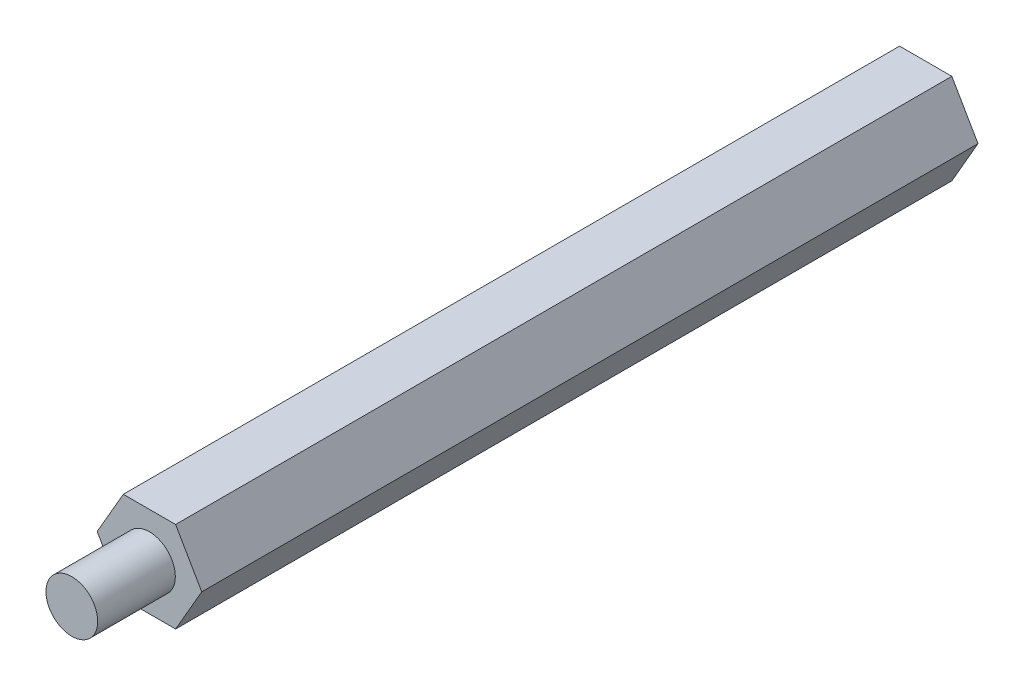
ISO-10303-21;
HEADER;
FILE_DESCRIPTION(('STEP AP214'),'2;1');
FILE_NAME('part.step','',(''),(''),'','','');
FILE_SCHEMA(('AUTOMOTIVE_DESIGN { 1 0 10303 214 1 1 1 1 }'));
ENDSEC;
DATA;
#1=APPLICATION_CONTEXT('core data for automotive mechanical design processes');
#2=APPLICATION_PROTOCOL_DEFINITION('international standard','automotive_design',2000,#1);
#3=PRODUCT_CONTEXT('',#1,'mechanical');
#4=PRODUCT('Part','Part','',(#3));
#5=PRODUCT_RELATED_PRODUCT_CATEGORY('part','',(#4));
#6=PRODUCT_DEFINITION_FORMATION('','',#4);
#7=PRODUCT_DEFINITION_CONTEXT('part definition',#1,'design');
#8=PRODUCT_DEFINITION('design','',#6,#7);
#9=PRODUCT_DEFINITION_SHAPE('','',#8);
#10=(LENGTH_UNIT() NAMED_UNIT(*) SI_UNIT(.MILLI.,.METRE.));
#11=(NAMED_UNIT(*) PLANE_ANGLE_UNIT() SI_UNIT($,.RADIAN.));
#12=(NAMED_UNIT(*) SI_UNIT($,.STERADIAN.) SOLID_ANGLE_UNIT());
#13=UNCERTAINTY_MEASURE_WITH_UNIT(LENGTH_MEASURE(1.E-05),#10,'distance_accuracy_value','');
#14=(GEOMETRIC_REPRESENTATION_CONTEXT(3) GLOBAL_UNCERTAINTY_ASSIGNED_CONTEXT((#13)) GLOBAL_UNIT_ASSIGNED_CONTEXT((#10,
#11,#12)) REPRESENTATION_CONTEXT('',''));
#15=CARTESIAN_POINT('',(0.,0.,0.));
#16=DIRECTION('',(0.,0.,1.));
#17=DIRECTION('',(1.,0.,0.));
#18=AXIS2_PLACEMENT_3D('',#15,#16,#17);
#19=CARTESIAN_POINT('',(2.02072594216373,-3.49999999999999,60.));
#20=DIRECTION('',(-0.866025403784441,0.499999999999996,0.));
#21=DIRECTION('',(-0.499999999999996,-0.866025403784441,0.));
#22=AXIS2_PLACEMENT_3D('',#19,#20,#21);
#23=PLANE('',#22);
#24=DIRECTION('',(0.499999999999996,0.866025403784441,0.));
#25=VECTOR('',#24,1.);
#26=CARTESIAN_POINT('',(2.02072594216373,-3.49999999999999,0.));
#27=LINE('',#26,#25);
#28=CARTESIAN_POINT('',(2.02072594216373,-3.49999999999999,0.));
#29=VERTEX_POINT('',#28);
#30=CARTESIAN_POINT('',(4.04145188432739,0.,0.));
#31=VERTEX_POINT('',#30);
#32=EDGE_CURVE('E126',#29,#31,#27,.T.);
#33=ORIENTED_EDGE('',*,*,#32,.T.);
#34=DIRECTION('',(0.,0.,-1.));
#35=VECTOR('',#34,1.);
#36=CARTESIAN_POINT('',(4.04145188432739,0.,60.));
#37=LINE('',#36,#35);
#38=CARTESIAN_POINT('',(4.04145188432739,0.,60.));
#39=VERTEX_POINT('',#38);
#40=EDGE_CURVE('E41',#39,#31,#37,.T.);
#41=ORIENTED_EDGE('',*,*,#40,.F.);
#42=DIRECTION('',(0.499999999999996,0.866025403784441,0.));
#43=VECTOR('',#42,1.);
#44=CARTESIAN_POINT('',(2.02072594216373,-3.49999999999999,60.));
#45=LINE('',#44,#43);
#46=CARTESIAN_POINT('',(2.02072594216373,-3.49999999999999,60.));
#47=VERTEX_POINT('',#46);
#48=EDGE_CURVE('E137',#47,#39,#45,.T.);
#49=ORIENTED_EDGE('',*,*,#48,.F.);
#50=DIRECTION('',(0.,0.,-1.));
#51=VECTOR('',#50,1.);
#52=CARTESIAN_POINT('',(2.02072594216373,-3.49999999999999,60.));
#53=LINE('',#52,#51);
#54=EDGE_CURVE('E122',#47,#29,#53,.T.);
#55=ORIENTED_EDGE('',*,*,#54,.T.);
#56=EDGE_LOOP('',(#33,#41,#49,#55));
#57=FACE_BOUND('',#56,.T.);
#58=ADVANCED_FACE('F38',(#57),#23,.F.);
#59=CARTESIAN_POINT('',(4.04145188432739,0.,60.));
#60=DIRECTION('',(-0.866025403784435,-0.500000000000006,0.));
#61=DIRECTION('',(0.500000000000006,-0.866025403784435,0.));
#62=AXIS2_PLACEMENT_3D('',#59,#60,#61);
#63=PLANE('',#62);
#64=DIRECTION('',(-0.500000000000006,0.866025403784435,0.));
#65=VECTOR('',#64,1.);
#66=CARTESIAN_POINT('',(4.04145188432739,0.,0.));
#67=LINE('',#66,#65);
#68=CARTESIAN_POINT('',(2.02072594216366,3.50000000000001,0.));
#69=VERTEX_POINT('',#68);
#70=EDGE_CURVE('E129',#31,#69,#67,.T.);
#71=ORIENTED_EDGE('',*,*,#70,.T.);
#72=DIRECTION('',(0.,0.,-1.));
#73=VECTOR('',#72,1.);
#74=CARTESIAN_POINT('',(2.02072594216366,3.50000000000001,60.));
#75=LINE('',#74,#73);
#76=CARTESIAN_POINT('',(2.02072594216366,3.50000000000001,60.));
#77=VERTEX_POINT('',#76);
#78=EDGE_CURVE('E140',#77,#69,#75,.T.);
#79=ORIENTED_EDGE('',*,*,#78,.F.);
#80=DIRECTION('',(-0.500000000000006,0.866025403784435,0.));
#81=VECTOR('',#80,1.);
#82=CARTESIAN_POINT('',(4.04145188432739,0.,60.));
#83=LINE('',#82,#81);
#84=EDGE_CURVE('E94',#39,#77,#83,.T.);
#85=ORIENTED_EDGE('',*,*,#84,.F.);
#86=ORIENTED_EDGE('',*,*,#40,.T.);
#87=EDGE_LOOP('',(#71,#79,#85,#86));
#88=FACE_BOUND('',#87,.T.);
#89=ADVANCED_FACE('F145',(#88),#63,.F.);
#90=CARTESIAN_POINT('',(2.02072594216366,3.50000000000001,60.));
#91=DIRECTION('',(0.,-1.,0.));
#92=DIRECTION('',(1.,0.,0.));
#93=AXIS2_PLACEMENT_3D('',#90,#91,#92);
#94=PLANE('',#93);
#95=DIRECTION('',(-1.,0.,0.));
#96=VECTOR('',#95,1.);
#97=CARTESIAN_POINT('',(2.02072594216366,3.50000000000001,0.));
#98=LINE('',#97,#96);
#99=CARTESIAN_POINT('',(-2.02072594216371,3.49999999999999,0.));
#100=VERTEX_POINT('',#99);
#101=EDGE_CURVE('E132',#69,#100,#98,.T.);
#102=ORIENTED_EDGE('',*,*,#101,.T.);
#103=DIRECTION('',(0.,0.,-1.));
#104=VECTOR('',#103,1.);
#105=CARTESIAN_POINT('',(-2.02072594216371,3.49999999999999,60.));
#106=LINE('',#105,#104);
#107=CARTESIAN_POINT('',(-2.02072594216371,3.49999999999999,60.));
#108=VERTEX_POINT('',#107);
#109=EDGE_CURVE('E117',#108,#100,#106,.T.);
#110=ORIENTED_EDGE('',*,*,#109,.F.);
#111=DIRECTION('',(-1.,0.,0.));
#112=VECTOR('',#111,1.);
#113=CARTESIAN_POINT('',(2.02072594216366,3.50000000000001,60.));
#114=LINE('',#113,#112);
#115=EDGE_CURVE('E108',#77,#108,#114,.T.);
#116=ORIENTED_EDGE('',*,*,#115,.F.);
#117=ORIENTED_EDGE('',*,*,#78,.T.);
#118=EDGE_LOOP('',(#102,#110,#116,#117));
#119=FACE_BOUND('',#118,.T.);
#120=ADVANCED_FACE('F151',(#119),#94,.F.);
#121=CARTESIAN_POINT('',(-2.02072594216371,3.49999999999999,60.));
#122=DIRECTION('',(0.866025403784442,-0.499999999999995,0.));
#123=DIRECTION('',(0.499999999999995,0.866025403784442,0.));
#124=AXIS2_PLACEMENT_3D('',#121,#122,#123);
#125=PLANE('',#124);
#126=DIRECTION('',(-0.499999999999995,-0.866025403784442,0.));
#127=VECTOR('',#126,1.);
#128=CARTESIAN_POINT('',(-2.02072594216371,3.49999999999999,0.));
#129=LINE('',#128,#127);
#130=CARTESIAN_POINT('',(-4.04145188432738,0.,0.));
#131=VERTEX_POINT('',#130);
#132=EDGE_CURVE('E116',#100,#131,#129,.T.);
#133=ORIENTED_EDGE('',*,*,#132,.T.);
#134=DIRECTION('',(0.,0.,-1.));
#135=VECTOR('',#134,1.);
#136=CARTESIAN_POINT('',(-4.04145188432738,0.,60.));
#137=LINE('',#136,#135);
#138=CARTESIAN_POINT('',(-4.04145188432738,0.,60.));
#139=VERTEX_POINT('',#138);
#140=EDGE_CURVE('E113',#139,#131,#137,.T.);
#141=ORIENTED_EDGE('',*,*,#140,.F.);
#142=DIRECTION('',(-0.499999999999995,-0.866025403784442,0.));
#143=VECTOR('',#142,1.);
#144=CARTESIAN_POINT('',(-2.02072594216371,3.49999999999999,60.));
#145=LINE('',#144,#143);
#146=EDGE_CURVE('E102',#108,#139,#145,.T.);
#147=ORIENTED_EDGE('',*,*,#146,.F.);
#148=ORIENTED_EDGE('',*,*,#109,.T.);
#149=EDGE_LOOP('',(#133,#141,#147,#148));
#150=FACE_BOUND('',#149,.T.);
#151=ADVANCED_FACE('F114',(#150),#125,.F.);
#152=CARTESIAN_POINT('',(-4.04145188432738,0.,60.));
#153=DIRECTION('',(0.866025403784436,0.500000000000004,0.));
#154=DIRECTION('',(-0.500000000000004,0.866025403784437,0.));
#155=AXIS2_PLACEMENT_3D('',#152,#153,#154);
#156=PLANE('',#155);
#157=DIRECTION('',(0.500000000000004,-0.866025403784436,0.));
#158=VECTOR('',#157,1.);
#159=CARTESIAN_POINT('',(-4.04145188432738,0.,0.));
#160=LINE('',#159,#158);
#161=CARTESIAN_POINT('',(-2.02072594216367,-3.50000000000001,0.));
#162=VERTEX_POINT('',#161);
#163=EDGE_CURVE('E79',#131,#162,#160,.T.);
#164=ORIENTED_EDGE('',*,*,#163,.T.);
#165=DIRECTION('',(0.,0.,-1.));
#166=VECTOR('',#165,1.);
#167=CARTESIAN_POINT('',(-2.02072594216367,-3.50000000000001,60.));
#168=LINE('',#167,#166);
#169=CARTESIAN_POINT('',(-2.02072594216367,-3.50000000000001,60.));
#170=VERTEX_POINT('',#169);
#171=EDGE_CURVE('E118',#170,#162,#168,.T.);
#172=ORIENTED_EDGE('',*,*,#171,.F.);
#173=DIRECTION('',(0.500000000000004,-0.866025403784436,0.));
#174=VECTOR('',#173,1.);
#175=CARTESIAN_POINT('',(-4.04145188432738,0.,60.));
#176=LINE('',#175,#174);
#177=EDGE_CURVE('E106',#139,#170,#176,.T.);
#178=ORIENTED_EDGE('',*,*,#177,.F.);
#179=ORIENTED_EDGE('',*,*,#140,.T.);
#180=EDGE_LOOP('',(#164,#172,#178,#179));
#181=FACE_BOUND('',#180,.T.);
#182=ADVANCED_FACE('F120',(#181),#156,.F.);
#183=CARTESIAN_POINT('',(-2.02072594216367,-3.50000000000001,60.));
#184=DIRECTION('',(0.,1.,0.));
#185=DIRECTION('',(-1.,0.,0.));
#186=AXIS2_PLACEMENT_3D('',#183,#184,#185);
#187=PLANE('',#186);
#188=DIRECTION('',(1.,0.,0.));
#189=VECTOR('',#188,1.);
#190=CARTESIAN_POINT('',(-2.02072594216367,-3.50000000000001,0.));
#191=LINE('',#190,#189);
#192=EDGE_CURVE('E85',#162,#29,#191,.T.);
#193=ORIENTED_EDGE('',*,*,#192,.T.);
#194=ORIENTED_EDGE('',*,*,#54,.F.);
#195=DIRECTION('',(1.,0.,0.));
#196=VECTOR('',#195,1.);
#197=CARTESIAN_POINT('',(-2.02072594216367,-3.50000000000001,60.));
#198=LINE('',#197,#196);
#199=EDGE_CURVE('E55',#170,#47,#198,.T.);
#200=ORIENTED_EDGE('',*,*,#199,.F.);
#201=ORIENTED_EDGE('',*,*,#171,.T.);
#202=EDGE_LOOP('',(#193,#194,#200,#201));
#203=FACE_BOUND('',#202,.T.);
#204=ADVANCED_FACE('F176',(#203),#187,.F.);
#205=CARTESIAN_POINT('',(0.,0.,60.));
#206=DIRECTION('',(0.,0.,1.));
#207=DIRECTION('',(1.,0.,0.));
#208=AXIS2_PLACEMENT_3D('',#205,#206,#207);
#209=PLANE('',#208);
#210=CARTESIAN_POINT('',(0.,0.,60.));
#211=DIRECTION('',(0.,0.,1.));
#212=DIRECTION('',(1.,0.,0.));
#213=AXIS2_PLACEMENT_3D('',#210,#211,#212);
#214=CIRCLE('',#213,2.);
#215=CARTESIAN_POINT('',(2.,0.,60.));
#216=VERTEX_POINT('',#215);
#217=EDGE_CURVE('E11',#216,#216,#214,.T.);
#218=ORIENTED_EDGE('',*,*,#217,.F.);
#219=EDGE_LOOP('',(#218));
#220=FACE_BOUND('',#219,.T.);
#221=ORIENTED_EDGE('',*,*,#48,.T.);
#222=ORIENTED_EDGE('',*,*,#84,.T.);
#223=ORIENTED_EDGE('',*,*,#115,.T.);
#224=ORIENTED_EDGE('',*,*,#146,.T.);
#225=ORIENTED_EDGE('',*,*,#177,.T.);
#226=ORIENTED_EDGE('',*,*,#199,.T.);
#227=EDGE_LOOP('',(#221,#222,#223,#224,#225,#226));
#228=FACE_BOUND('',#227,.T.);
#229=ADVANCED_FACE('F104',(#220,#228),#209,.T.);
#230=CARTESIAN_POINT('',(0.,0.,0.));
#231=DIRECTION('',(0.,0.,1.));
#232=DIRECTION('',(1.,0.,0.));
#233=AXIS2_PLACEMENT_3D('',#230,#231,#232);
#234=PLANE('',#233);
#235=CARTESIAN_POINT('',(0.,0.,0.));
#236=DIRECTION('',(0.,0.,-1.));
#237=DIRECTION('',(-1.,0.,0.));
#238=AXIS2_PLACEMENT_3D('',#235,#236,#237);
#239=CIRCLE('',#238,1.65);
#240=CARTESIAN_POINT('',(-1.65,0.,0.));
#241=VERTEX_POINT('',#240);
#242=EDGE_CURVE('E160',#241,#241,#239,.T.);
#243=ORIENTED_EDGE('',*,*,#242,.F.);
#244=EDGE_LOOP('',(#243));
#245=FACE_BOUND('',#244,.T.);
#246=ORIENTED_EDGE('',*,*,#32,.F.);
#247=ORIENTED_EDGE('',*,*,#192,.F.);
#248=ORIENTED_EDGE('',*,*,#163,.F.);
#249=ORIENTED_EDGE('',*,*,#132,.F.);
#250=ORIENTED_EDGE('',*,*,#101,.F.);
#251=ORIENTED_EDGE('',*,*,#70,.F.);
#252=EDGE_LOOP('',(#246,#247,#248,#249,#250,#251));
#253=FACE_BOUND('',#252,.T.);
#254=ADVANCED_FACE('F150',(#245,#253),#234,.F.);
#255=CARTESIAN_POINT('',(0.,0.,66.));
#256=DIRECTION('',(0.,0.,-1.));
#257=DIRECTION('',(-1.,0.,0.));
#258=AXIS2_PLACEMENT_3D('',#255,#256,#257);
#259=CYLINDRICAL_SURFACE('',#258,2.);
#260=CARTESIAN_POINT('',(0.,0.,66.));
#261=DIRECTION('',(0.,0.,1.));
#262=DIRECTION('',(1.,0.,0.));
#263=AXIS2_PLACEMENT_3D('',#260,#261,#262);
#264=CIRCLE('',#263,2.);
#265=CARTESIAN_POINT('',(2.,0.,66.));
#266=VERTEX_POINT('',#265);
#267=EDGE_CURVE('E130',#266,#266,#264,.T.);
#268=ORIENTED_EDGE('',*,*,#267,.F.);
#269=EDGE_LOOP('',(#268));
#270=FACE_BOUND('',#269,.T.);
#271=ORIENTED_EDGE('',*,*,#217,.T.);
#272=EDGE_LOOP('',(#271));
#273=FACE_BOUND('',#272,.T.);
#274=ADVANCED_FACE('F167',(#270,#273),#259,.T.);
#275=CARTESIAN_POINT('',(0.,0.,66.));
#276=DIRECTION('',(0.,0.,1.));
#277=DIRECTION('',(1.,0.,0.));
#278=AXIS2_PLACEMENT_3D('',#275,#276,#277);
#279=PLANE('',#278);
#280=ORIENTED_EDGE('',*,*,#267,.T.);
#281=EDGE_LOOP('',(#280));
#282=FACE_BOUND('',#281,.T.);
#283=ADVANCED_FACE('F173',(#282),#279,.T.);
#284=CARTESIAN_POINT('',(0.,0.,10.5));
#285=DIRECTION('',(0.,0.,-1.));
#286=DIRECTION('',(-1.,0.,0.));
#287=AXIS2_PLACEMENT_3D('',#284,#285,#286);
#288=CONICAL_SURFACE('',#287,1.65,1.02974425867665);
#289=CARTESIAN_POINT('',(0.,0.,11.4914200213955));
#290=VERTEX_POINT('',#289);
#291=VERTEX_LOOP('',#290);
#292=FACE_BOUND('',#291,.T.);
#293=CARTESIAN_POINT('',(0.,0.,10.5));
#294=DIRECTION('',(0.,0.,-1.));
#295=DIRECTION('',(-1.,0.,0.));
#296=AXIS2_PLACEMENT_3D('',#293,#294,#295);
#297=CIRCLE('',#296,1.65);
#298=CARTESIAN_POINT('',(-1.65,0.,10.5));
#299=VERTEX_POINT('',#298);
#300=EDGE_CURVE('E157',#299,#299,#297,.T.);
#301=ORIENTED_EDGE('',*,*,#300,.T.);
#302=EDGE_LOOP('',(#301));
#303=FACE_BOUND('',#302,.T.);
#304=ADVANCED_FACE('F217',(#292,#303),#288,.F.);
#305=CARTESIAN_POINT('',(0.,0.,0.));
#306=DIRECTION('',(0.,0.,-1.));
#307=DIRECTION('',(-1.,0.,0.));
#308=AXIS2_PLACEMENT_3D('',#305,#306,#307);
#309=CYLINDRICAL_SURFACE('',#308,1.65);
#310=ORIENTED_EDGE('',*,*,#300,.F.);
#311=EDGE_LOOP('',(#310));
#312=FACE_BOUND('',#311,.T.);
#313=ORIENTED_EDGE('',*,*,#242,.T.);
#314=EDGE_LOOP('',(#313));
#315=FACE_BOUND('',#314,.T.);
#316=ADVANCED_FACE('F164',(#312,#315),#309,.F.);
#317=CLOSED_SHELL('',(#58,#89,#120,#151,#182,#204,#229,#254,#274,#283,#304,#316));
#318=MANIFOLD_SOLID_BREP('B2',#317);
#319=ADVANCED_BREP_SHAPE_REPRESENTATION('',(#18,#318),#14);
#320=SHAPE_DEFINITION_REPRESENTATION(#9,#319);
ENDSEC;
END-ISO-10303-21;
